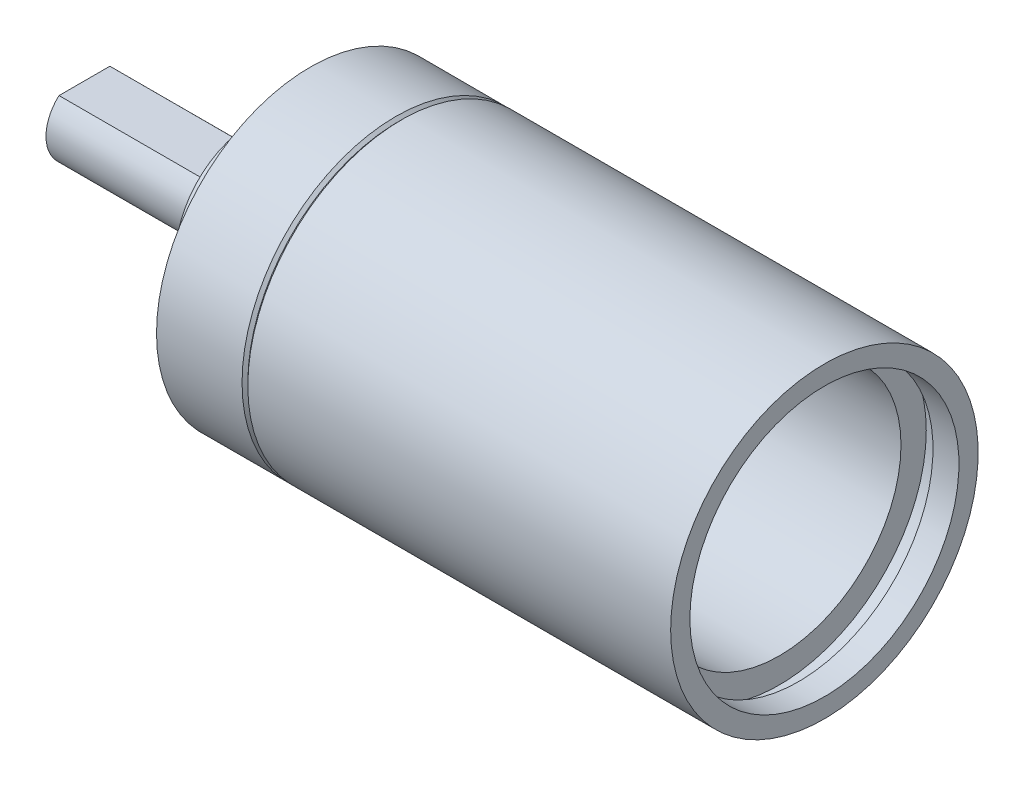
ISO-10303-21;
HEADER;
FILE_DESCRIPTION(('STEP AP214'),'2;1');
FILE_NAME('part.step','',(''),(''),'','','');
FILE_SCHEMA(('AUTOMOTIVE_DESIGN { 1 0 10303 214 1 1 1 1 }'));
ENDSEC;
DATA;
#1=APPLICATION_CONTEXT('core data for automotive mechanical design processes');
#2=APPLICATION_PROTOCOL_DEFINITION('international standard','automotive_design',2000,#1);
#3=PRODUCT_CONTEXT('',#1,'mechanical');
#4=PRODUCT('Part','Part','',(#3));
#5=PRODUCT_RELATED_PRODUCT_CATEGORY('part','',(#4));
#6=PRODUCT_DEFINITION_FORMATION('','',#4);
#7=PRODUCT_DEFINITION_CONTEXT('part definition',#1,'design');
#8=PRODUCT_DEFINITION('design','',#6,#7);
#9=PRODUCT_DEFINITION_SHAPE('','',#8);
#10=(LENGTH_UNIT() NAMED_UNIT(*) SI_UNIT(.MILLI.,.METRE.));
#11=(NAMED_UNIT(*) PLANE_ANGLE_UNIT() SI_UNIT($,.RADIAN.));
#12=(NAMED_UNIT(*) SI_UNIT($,.STERADIAN.) SOLID_ANGLE_UNIT());
#13=UNCERTAINTY_MEASURE_WITH_UNIT(LENGTH_MEASURE(1.E-05),#10,'distance_accuracy_value','');
#14=(GEOMETRIC_REPRESENTATION_CONTEXT(3) GLOBAL_UNCERTAINTY_ASSIGNED_CONTEXT((#13)) GLOBAL_UNIT_ASSIGNED_CONTEXT((#10,
#11,#12)) REPRESENTATION_CONTEXT('',''));
#15=CARTESIAN_POINT('',(0.,0.,0.));
#16=DIRECTION('',(0.,0.,1.));
#17=DIRECTION('',(1.,0.,0.));
#18=AXIS2_PLACEMENT_3D('',#15,#16,#17);
#19=CARTESIAN_POINT('',(-38.5000000000001,0.,0.));
#20=DIRECTION('',(-1.,0.,0.));
#21=DIRECTION('',(0.,0.,1.));
#22=AXIS2_PLACEMENT_3D('',#19,#20,#21);
#23=PLANE('',#22);
#24=CARTESIAN_POINT('',(-38.5000000000001,0.,0.));
#25=DIRECTION('',(-1.,0.,0.));
#26=DIRECTION('',(0.,0.,1.));
#27=AXIS2_PLACEMENT_3D('',#24,#25,#26);
#28=CIRCLE('',#27,2.);
#29=CARTESIAN_POINT('',(-38.5,1.50000000000003,1.32287565553226));
#30=VERTEX_POINT('',#29);
#31=CARTESIAN_POINT('',(-38.5,1.50000000000002,-1.32287565553225));
#32=VERTEX_POINT('',#31);
#33=EDGE_CURVE('E21',#30,#32,#28,.F.);
#34=ORIENTED_EDGE('',*,*,#33,.F.);
#35=DIRECTION('',(0.,0.,-1.));
#36=VECTOR('',#35,1.);
#37=CARTESIAN_POINT('',(-38.5,1.5,5.));
#38=LINE('',#37,#36);
#39=EDGE_CURVE('E59',#30,#32,#38,.T.);
#40=ORIENTED_EDGE('',*,*,#39,.T.);
#41=EDGE_LOOP('',(#34,#40));
#42=FACE_BOUND('',#41,.T.);
#43=ADVANCED_FACE('F18',(#42),#23,.T.);
#44=CARTESIAN_POINT('',(-30.5,1.5,5.));
#45=DIRECTION('',(0.707106781186547,-0.707106781186548,0.));
#46=DIRECTION('',(0.707106781186548,0.707106781186547,0.));
#47=AXIS2_PLACEMENT_3D('',#44,#45,#46);
#48=PLANE('',#47);
#49=DIRECTION('',(0.,0.,-1.));
#50=VECTOR('',#49,1.);
#51=CARTESIAN_POINT('',(-30.5,1.5,5.));
#52=LINE('',#51,#50);
#53=CARTESIAN_POINT('',(-30.4999999999999,1.50000000000004,-1.32287565553225));
#54=VERTEX_POINT('',#53);
#55=CARTESIAN_POINT('',(-30.4999999999999,1.50000000000003,1.32287565553226));
#56=VERTEX_POINT('',#55);
#57=EDGE_CURVE('E70',#54,#56,#52,.F.);
#58=ORIENTED_EDGE('',*,*,#57,.T.);
#59=CARTESIAN_POINT('',(-32.,0.,0.));
#60=DIRECTION('',(0.707106781186547,-0.707106781186548,0.));
#61=DIRECTION('',(-0.707106781186548,-0.707106781186547,0.));
#62=AXIS2_PLACEMENT_3D('',#59,#60,#61);
#63=ELLIPSE('',#62,2.82842712474619,2.);
#64=EDGE_CURVE('E74',#54,#56,#63,.T.);
#65=ORIENTED_EDGE('',*,*,#64,.F.);
#66=EDGE_LOOP('',(#58,#65));
#67=FACE_BOUND('',#66,.T.);
#68=ADVANCED_FACE('F157',(#67),#48,.F.);
#69=CARTESIAN_POINT('',(-38.5,1.5,5.));
#70=DIRECTION('',(0.,-1.,0.));
#71=DIRECTION('',(0.,0.,-1.));
#72=AXIS2_PLACEMENT_3D('',#69,#70,#71);
#73=PLANE('',#72);
#74=ORIENTED_EDGE('',*,*,#39,.F.);
#75=DIRECTION('',(-1.,0.,0.));
#76=VECTOR('',#75,1.);
#77=CARTESIAN_POINT('',(1.92499999999995,1.50000000000007,1.32287565553222));
#78=LINE('',#77,#76);
#79=EDGE_CURVE('E68',#56,#30,#78,.T.);
#80=ORIENTED_EDGE('',*,*,#79,.F.);
#81=ORIENTED_EDGE('',*,*,#57,.F.);
#82=DIRECTION('',(-1.,0.,0.));
#83=VECTOR('',#82,1.);
#84=CARTESIAN_POINT('',(1.92499999999995,1.50000000000007,-1.32287565553221));
#85=LINE('',#84,#83);
#86=EDGE_CURVE('E64',#32,#54,#85,.F.);
#87=ORIENTED_EDGE('',*,*,#86,.F.);
#88=EDGE_LOOP('',(#74,#80,#81,#87));
#89=FACE_BOUND('',#88,.T.);
#90=ADVANCED_FACE('F67',(#89),#73,.F.);
#91=CARTESIAN_POINT('',(1.92499999999995,0.,0.));
#92=DIRECTION('',(-1.,0.,0.));
#93=DIRECTION('',(0.,0.,1.));
#94=AXIS2_PLACEMENT_3D('',#91,#92,#93);
#95=CYLINDRICAL_SURFACE('',#94,2.);
#96=CARTESIAN_POINT('',(-29.7500000000001,0.,0.));
#97=DIRECTION('',(-1.,0.,0.));
#98=DIRECTION('',(0.,0.,1.));
#99=AXIS2_PLACEMENT_3D('',#96,#97,#98);
#100=CIRCLE('',#99,2.);
#101=CARTESIAN_POINT('',(-29.7500000000001,0.,2.00000000000001));
#102=VERTEX_POINT('',#101);
#103=EDGE_CURVE('E75',#102,#102,#100,.F.);
#104=ORIENTED_EDGE('',*,*,#103,.F.);
#105=EDGE_LOOP('',(#104));
#106=FACE_BOUND('',#105,.T.);
#107=ORIENTED_EDGE('',*,*,#79,.T.);
#108=ORIENTED_EDGE('',*,*,#33,.T.);
#109=ORIENTED_EDGE('',*,*,#86,.T.);
#110=ORIENTED_EDGE('',*,*,#64,.T.);
#111=EDGE_LOOP('',(#107,#108,#109,#110));
#112=FACE_BOUND('',#111,.T.);
#113=ADVANCED_FACE('F72',(#106,#112),#95,.T.);
#114=CARTESIAN_POINT('',(-29.7500000000001,0.,0.));
#115=DIRECTION('',(-1.,0.,0.));
#116=DIRECTION('',(0.,0.,1.));
#117=AXIS2_PLACEMENT_3D('',#114,#115,#116);
#118=PLANE('',#117);
#119=CARTESIAN_POINT('',(-29.7500000000001,0.,0.));
#120=DIRECTION('',(-1.,0.,0.));
#121=DIRECTION('',(0.,0.,1.));
#122=AXIS2_PLACEMENT_3D('',#119,#120,#121);
#123=CIRCLE('',#122,4.);
#124=CARTESIAN_POINT('',(-29.7500000000001,0.,4.00000000000001));
#125=VERTEX_POINT('',#124);
#126=EDGE_CURVE('E78',#125,#125,#123,.F.);
#127=ORIENTED_EDGE('',*,*,#126,.F.);
#128=EDGE_LOOP('',(#127));
#129=FACE_BOUND('',#128,.T.);
#130=ORIENTED_EDGE('',*,*,#103,.T.);
#131=EDGE_LOOP('',(#130));
#132=FACE_BOUND('',#131,.T.);
#133=ADVANCED_FACE('F144',(#129,#132),#118,.T.);
#134=CARTESIAN_POINT('',(-21.7000000000001,0.,0.));
#135=DIRECTION('',(-1.,0.,0.));
#136=DIRECTION('',(0.,0.,1.));
#137=AXIS2_PLACEMENT_3D('',#134,#135,#136);
#138=PLANE('',#137);
#139=CARTESIAN_POINT('',(-21.7000000000001,0.,0.));
#140=DIRECTION('',(-1.,0.,0.));
#141=DIRECTION('',(0.,0.,1.));
#142=AXIS2_PLACEMENT_3D('',#139,#140,#141);
#143=CIRCLE('',#142,6.335);
#144=CARTESIAN_POINT('',(-21.7000000000001,0.,6.335));
#145=VERTEX_POINT('',#144);
#146=EDGE_CURVE('E136',#145,#145,#143,.F.);
#147=ORIENTED_EDGE('',*,*,#146,.T.);
#148=EDGE_LOOP('',(#147));
#149=FACE_BOUND('',#148,.T.);
#150=ADVANCED_FACE('F147',(#149),#138,.F.);
#151=CARTESIAN_POINT('',(1.92499999999995,0.,0.));
#152=DIRECTION('',(-1.,0.,0.));
#153=DIRECTION('',(0.,0.,1.));
#154=AXIS2_PLACEMENT_3D('',#151,#152,#153);
#155=CYLINDRICAL_SURFACE('',#154,4.);
#156=CARTESIAN_POINT('',(-27.9,0.,0.));
#157=DIRECTION('',(-1.,0.,0.));
#158=DIRECTION('',(0.,0.,1.));
#159=AXIS2_PLACEMENT_3D('',#156,#157,#158);
#160=CIRCLE('',#159,4.);
#161=CARTESIAN_POINT('',(-27.9,0.,4.00000000000001));
#162=VERTEX_POINT('',#161);
#163=EDGE_CURVE('E133',#162,#162,#160,.F.);
#164=ORIENTED_EDGE('',*,*,#163,.F.);
#165=EDGE_LOOP('',(#164));
#166=FACE_BOUND('',#165,.T.);
#167=ORIENTED_EDGE('',*,*,#126,.T.);
#168=EDGE_LOOP('',(#167));
#169=FACE_BOUND('',#168,.T.);
#170=ADVANCED_FACE('F142',(#166,#169),#155,.T.);
#171=CARTESIAN_POINT('',(1.92499999999995,0.,0.));
#172=DIRECTION('',(-1.,0.,0.));
#173=DIRECTION('',(0.,0.,1.));
#174=AXIS2_PLACEMENT_3D('',#171,#172,#173);
#175=CYLINDRICAL_SURFACE('',#174,6.335);
#176=CARTESIAN_POINT('',(-2.35000000000002,0.,0.));
#177=DIRECTION('',(-1.,0.,0.));
#178=DIRECTION('',(0.,0.,1.));
#179=AXIS2_PLACEMENT_3D('',#176,#177,#178);
#180=CIRCLE('',#179,6.335);
#181=CARTESIAN_POINT('',(-2.35000000000002,0.,6.33500000000001));
#182=VERTEX_POINT('',#181);
#183=EDGE_CURVE('E130',#182,#182,#180,.F.);
#184=ORIENTED_EDGE('',*,*,#183,.T.);
#185=EDGE_LOOP('',(#184));
#186=FACE_BOUND('',#185,.T.);
#187=ORIENTED_EDGE('',*,*,#146,.F.);
#188=EDGE_LOOP('',(#187));
#189=FACE_BOUND('',#188,.T.);
#190=ADVANCED_FACE('F257',(#186,#189),#175,.F.);
#191=CARTESIAN_POINT('',(-22.872748738564,3.25,5.629165124599));
#192=DIRECTION('',(-1.,0.,0.));
#193=DIRECTION('',(0.,0.,1.));
#194=AXIS2_PLACEMENT_3D('',#191,#192,#193);
#195=CONICAL_SURFACE('',#194,0.870000000002384,1.02974425843473);
#196=CARTESIAN_POINT('',(-22.349999999733,3.25,5.62916512447487));
#197=VERTEX_POINT('',#196);
#198=VERTEX_LOOP('',#197);
#199=FACE_BOUND('',#198,.T.);
#200=CARTESIAN_POINT('',(-22.8727487385501,3.25,5.629165124599));
#201=DIRECTION('',(1.,0.,0.));
#202=DIRECTION('',(0.,0.,-1.));
#203=AXIS2_PLACEMENT_3D('',#200,#201,#202);
#204=CIRCLE('',#203,0.87);
#205=CARTESIAN_POINT('',(-22.8727487385501,3.25,4.759165124599));
#206=VERTEX_POINT('',#205);
#207=EDGE_CURVE('E82',#206,#206,#204,.F.);
#208=ORIENTED_EDGE('',*,*,#207,.T.);
#209=EDGE_LOOP('',(#208));
#210=FACE_BOUND('',#209,.T.);
#211=ADVANCED_FACE('F253',(#199,#210),#195,.F.);
#212=CARTESIAN_POINT('',(-22.872748738564,-3.25,5.62916512459901));
#213=DIRECTION('',(-1.,0.,0.));
#214=DIRECTION('',(0.,0.,1.));
#215=AXIS2_PLACEMENT_3D('',#212,#213,#214);
#216=CONICAL_SURFACE('',#215,0.870000000002387,1.02974425843474);
#217=CARTESIAN_POINT('',(-22.349999999733,-3.25,5.62916512459901));
#218=VERTEX_POINT('',#217);
#219=VERTEX_LOOP('',#218);
#220=FACE_BOUND('',#219,.T.);
#221=CARTESIAN_POINT('',(-22.8727487385501,-3.25000000000001,5.629165124599));
#222=DIRECTION('',(1.,0.,0.));
#223=DIRECTION('',(0.,0.,-1.));
#224=AXIS2_PLACEMENT_3D('',#221,#222,#223);
#225=CIRCLE('',#224,0.87);
#226=CARTESIAN_POINT('',(-22.8727487385501,-3.25000000000001,4.759165124599));
#227=VERTEX_POINT('',#226);
#228=EDGE_CURVE('E478',#227,#227,#225,.F.);
#229=ORIENTED_EDGE('',*,*,#228,.T.);
#230=EDGE_LOOP('',(#229));
#231=FACE_BOUND('',#230,.T.);
#232=ADVANCED_FACE('F249',(#220,#231),#216,.F.);
#233=CARTESIAN_POINT('',(-22.8727487385072,-6.5,0.));
#234=DIRECTION('',(-1.,0.,0.));
#235=DIRECTION('',(0.,0.,1.));
#236=AXIS2_PLACEMENT_3D('',#233,#234,#235);
#237=CONICAL_SURFACE('',#236,0.869999999906668,1.02974425821274);
#238=CARTESIAN_POINT('',(-22.3499999996193,-6.5,0.));
#239=VERTEX_POINT('',#238);
#240=VERTEX_LOOP('',#239);
#241=FACE_BOUND('',#240,.T.);
#242=CARTESIAN_POINT('',(-22.8727487385501,-6.5,0.));
#243=DIRECTION('',(1.,0.,0.));
#244=DIRECTION('',(0.,0.,-1.));
#245=AXIS2_PLACEMENT_3D('',#242,#243,#244);
#246=CIRCLE('',#245,0.87);
#247=CARTESIAN_POINT('',(-22.8727487385501,-6.5,-0.869999999999986));
#248=VERTEX_POINT('',#247);
#249=EDGE_CURVE('E480',#248,#248,#246,.F.);
#250=ORIENTED_EDGE('',*,*,#249,.T.);
#251=EDGE_LOOP('',(#250));
#252=FACE_BOUND('',#251,.T.);
#253=ADVANCED_FACE('F245',(#241,#252),#237,.F.);
#254=CARTESIAN_POINT('',(-22.8727487386209,-3.25,-5.62916512459899));
#255=DIRECTION('',(-1.,0.,0.));
#256=DIRECTION('',(0.,0.,1.));
#257=AXIS2_PLACEMENT_3D('',#254,#255,#256);
#258=CONICAL_SURFACE('',#257,0.869999999981497,1.02974425833669);
#259=CARTESIAN_POINT('',(-22.3499999997614,-3.25,-5.62916512467382));
#260=VERTEX_POINT('',#259);
#261=VERTEX_LOOP('',#260);
#262=FACE_BOUND('',#261,.T.);
#263=CARTESIAN_POINT('',(-22.8727487385501,-3.25000000000001,-5.629165124599));
#264=DIRECTION('',(1.,0.,0.));
#265=DIRECTION('',(0.,0.,-1.));
#266=AXIS2_PLACEMENT_3D('',#263,#264,#265);
#267=CIRCLE('',#266,0.87);
#268=CARTESIAN_POINT('',(-22.8727487385501,-3.25000000000001,-6.499165124599));
#269=VERTEX_POINT('',#268);
#270=EDGE_CURVE('E484',#269,#269,#267,.F.);
#271=ORIENTED_EDGE('',*,*,#270,.T.);
#272=EDGE_LOOP('',(#271));
#273=FACE_BOUND('',#272,.T.);
#274=ADVANCED_FACE('F241',(#262,#273),#258,.F.);
#275=CARTESIAN_POINT('',(-22.8727487386209,3.25,-5.629165124599));
#276=DIRECTION('',(-1.,0.,0.));
#277=DIRECTION('',(0.,0.,1.));
#278=AXIS2_PLACEMENT_3D('',#275,#276,#277);
#279=CONICAL_SURFACE('',#278,0.86999999998149,1.02974425833668);
#280=CARTESIAN_POINT('',(-22.3499999997898,3.25,-5.629165124599));
#281=VERTEX_POINT('',#280);
#282=VERTEX_LOOP('',#281);
#283=FACE_BOUND('',#282,.T.);
#284=CARTESIAN_POINT('',(-22.8727487385501,3.25,-5.62916512459898));
#285=DIRECTION('',(1.,0.,0.));
#286=DIRECTION('',(0.,0.,-1.));
#287=AXIS2_PLACEMENT_3D('',#284,#285,#286);
#288=CIRCLE('',#287,0.87);
#289=CARTESIAN_POINT('',(-22.8727487385501,3.25,-6.49916512459898));
#290=VERTEX_POINT('',#289);
#291=EDGE_CURVE('E489',#290,#290,#288,.F.);
#292=ORIENTED_EDGE('',*,*,#291,.T.);
#293=EDGE_LOOP('',(#292));
#294=FACE_BOUND('',#293,.T.);
#295=ADVANCED_FACE('F238',(#283,#294),#279,.F.);
#296=CARTESIAN_POINT('',(-22.8727487385072,6.5,0.));
#297=DIRECTION('',(-1.,0.,0.));
#298=DIRECTION('',(0.,0.,1.));
#299=AXIS2_PLACEMENT_3D('',#296,#297,#298);
#300=CONICAL_SURFACE('',#299,0.869999999906675,1.02974425821274);
#301=CARTESIAN_POINT('',(-22.3499999995909,6.5,5.68503758913403E-11));
#302=VERTEX_POINT('',#301);
#303=VERTEX_LOOP('',#302);
#304=FACE_BOUND('',#303,.T.);
#305=CARTESIAN_POINT('',(-22.8727487385501,6.5,0.));
#306=DIRECTION('',(1.,0.,0.));
#307=DIRECTION('',(0.,0.,-1.));
#308=AXIS2_PLACEMENT_3D('',#305,#306,#307);
#309=CIRCLE('',#308,0.87);
#310=CARTESIAN_POINT('',(-22.8727487385501,6.5,-0.869999999999993));
#311=VERTEX_POINT('',#310);
#312=EDGE_CURVE('E129',#311,#311,#309,.F.);
#313=ORIENTED_EDGE('',*,*,#312,.T.);
#314=EDGE_LOOP('',(#313));
#315=FACE_BOUND('',#314,.T.);
#316=ADVANCED_FACE('F234',(#304,#315),#300,.F.);
#317=CARTESIAN_POINT('',(-27.9,0.,0.));
#318=DIRECTION('',(-1.,0.,0.));
#319=DIRECTION('',(0.,0.,1.));
#320=AXIS2_PLACEMENT_3D('',#317,#318,#319);
#321=PLANE('',#320);
#322=CARTESIAN_POINT('',(-27.9,0.,0.));
#323=DIRECTION('',(-1.,0.,0.));
#324=DIRECTION('',(0.,0.,1.));
#325=AXIS2_PLACEMENT_3D('',#322,#323,#324);
#326=CIRCLE('',#325,5.);
#327=CARTESIAN_POINT('',(-27.9,0.,5.00000000000001));
#328=VERTEX_POINT('',#327);
#329=EDGE_CURVE('E126',#328,#328,#326,.F.);
#330=ORIENTED_EDGE('',*,*,#329,.F.);
#331=EDGE_LOOP('',(#330));
#332=FACE_BOUND('',#331,.T.);
#333=ORIENTED_EDGE('',*,*,#163,.T.);
#334=EDGE_LOOP('',(#333));
#335=FACE_BOUND('',#334,.T.);
#336=ADVANCED_FACE('F230',(#332,#335),#321,.T.);
#337=CARTESIAN_POINT('',(-2.35000000000002,0.,0.));
#338=DIRECTION('',(-1.,0.,0.));
#339=DIRECTION('',(0.,0.,1.));
#340=AXIS2_PLACEMENT_3D('',#337,#338,#339);
#341=PLANE('',#340);
#342=CARTESIAN_POINT('',(-2.35000000000002,0.,0.));
#343=DIRECTION('',(-1.,0.,0.));
#344=DIRECTION('',(0.,0.,1.));
#345=AXIS2_PLACEMENT_3D('',#342,#343,#344);
#346=CIRCLE('',#345,7.65);
#347=CARTESIAN_POINT('',(-2.35000000000002,0.,7.65000000000001));
#348=VERTEX_POINT('',#347);
#349=EDGE_CURVE('E123',#348,#348,#346,.F.);
#350=ORIENTED_EDGE('',*,*,#349,.T.);
#351=EDGE_LOOP('',(#350));
#352=FACE_BOUND('',#351,.T.);
#353=ORIENTED_EDGE('',*,*,#183,.F.);
#354=EDGE_LOOP('',(#353));
#355=FACE_BOUND('',#354,.T.);
#356=ADVANCED_FACE('F226',(#352,#355),#341,.F.);
#357=CARTESIAN_POINT('',(-26.97,3.25,5.629165124599));
#358=DIRECTION('',(1.,0.,0.));
#359=DIRECTION('',(0.,0.,-1.));
#360=AXIS2_PLACEMENT_3D('',#357,#358,#359);
#361=CYLINDRICAL_SURFACE('',#360,0.87);
#362=CARTESIAN_POINT('',(-26.75,3.25,5.629165124599));
#363=DIRECTION('',(1.,0.,0.));
#364=DIRECTION('',(0.,0.,-1.));
#365=AXIS2_PLACEMENT_3D('',#362,#363,#364);
#366=CIRCLE('',#365,0.87);
#367=CARTESIAN_POINT('',(-26.75,3.25,4.759165124599));
#368=VERTEX_POINT('',#367);
#369=EDGE_CURVE('E120',#368,#368,#366,.T.);
#370=ORIENTED_EDGE('',*,*,#369,.F.);
#371=EDGE_LOOP('',(#370));
#372=FACE_BOUND('',#371,.T.);
#373=ORIENTED_EDGE('',*,*,#207,.F.);
#374=EDGE_LOOP('',(#373));
#375=FACE_BOUND('',#374,.T.);
#376=ADVANCED_FACE('F222',(#372,#375),#361,.F.);
#377=CARTESIAN_POINT('',(-26.97,-3.25000000000001,5.629165124599));
#378=DIRECTION('',(1.,0.,0.));
#379=DIRECTION('',(0.,0.,-1.));
#380=AXIS2_PLACEMENT_3D('',#377,#378,#379);
#381=CYLINDRICAL_SURFACE('',#380,0.87);
#382=CARTESIAN_POINT('',(-26.75,-3.25000000000001,5.629165124599));
#383=DIRECTION('',(1.,0.,0.));
#384=DIRECTION('',(0.,0.,-1.));
#385=AXIS2_PLACEMENT_3D('',#382,#383,#384);
#386=CIRCLE('',#385,0.87);
#387=CARTESIAN_POINT('',(-26.75,-3.25000000000001,4.759165124599));
#388=VERTEX_POINT('',#387);
#389=EDGE_CURVE('E117',#388,#388,#386,.T.);
#390=ORIENTED_EDGE('',*,*,#389,.F.);
#391=EDGE_LOOP('',(#390));
#392=FACE_BOUND('',#391,.T.);
#393=ORIENTED_EDGE('',*,*,#228,.F.);
#394=EDGE_LOOP('',(#393));
#395=FACE_BOUND('',#394,.T.);
#396=ADVANCED_FACE('F218',(#392,#395),#381,.F.);
#397=CARTESIAN_POINT('',(-26.97,-6.5,0.));
#398=DIRECTION('',(1.,0.,0.));
#399=DIRECTION('',(0.,0.,-1.));
#400=AXIS2_PLACEMENT_3D('',#397,#398,#399);
#401=CYLINDRICAL_SURFACE('',#400,0.87);
#402=CARTESIAN_POINT('',(-26.75,-6.5,0.));
#403=DIRECTION('',(1.,0.,0.));
#404=DIRECTION('',(0.,0.,-1.));
#405=AXIS2_PLACEMENT_3D('',#402,#403,#404);
#406=CIRCLE('',#405,0.87);
#407=CARTESIAN_POINT('',(-26.75,-6.5,-0.869999999999986));
#408=VERTEX_POINT('',#407);
#409=EDGE_CURVE('E114',#408,#408,#406,.T.);
#410=ORIENTED_EDGE('',*,*,#409,.F.);
#411=EDGE_LOOP('',(#410));
#412=FACE_BOUND('',#411,.T.);
#413=ORIENTED_EDGE('',*,*,#249,.F.);
#414=EDGE_LOOP('',(#413));
#415=FACE_BOUND('',#414,.T.);
#416=ADVANCED_FACE('F214',(#412,#415),#401,.F.);
#417=CARTESIAN_POINT('',(-26.97,-3.25000000000001,-5.629165124599));
#418=DIRECTION('',(1.,0.,0.));
#419=DIRECTION('',(0.,0.,-1.));
#420=AXIS2_PLACEMENT_3D('',#417,#418,#419);
#421=CYLINDRICAL_SURFACE('',#420,0.87);
#422=CARTESIAN_POINT('',(-26.75,-3.25000000000001,-5.629165124599));
#423=DIRECTION('',(1.,0.,0.));
#424=DIRECTION('',(0.,0.,-1.));
#425=AXIS2_PLACEMENT_3D('',#422,#423,#424);
#426=CIRCLE('',#425,0.87);
#427=CARTESIAN_POINT('',(-26.75,-3.25000000000001,-6.499165124599));
#428=VERTEX_POINT('',#427);
#429=EDGE_CURVE('E111',#428,#428,#426,.T.);
#430=ORIENTED_EDGE('',*,*,#429,.F.);
#431=EDGE_LOOP('',(#430));
#432=FACE_BOUND('',#431,.T.);
#433=ORIENTED_EDGE('',*,*,#270,.F.);
#434=EDGE_LOOP('',(#433));
#435=FACE_BOUND('',#434,.T.);
#436=ADVANCED_FACE('F210',(#432,#435),#421,.F.);
#437=CARTESIAN_POINT('',(-26.97,3.25,-5.62916512459898));
#438=DIRECTION('',(1.,0.,0.));
#439=DIRECTION('',(0.,0.,-1.));
#440=AXIS2_PLACEMENT_3D('',#437,#438,#439);
#441=CYLINDRICAL_SURFACE('',#440,0.87);
#442=CARTESIAN_POINT('',(-26.75,3.25,-5.62916512459898));
#443=DIRECTION('',(1.,0.,0.));
#444=DIRECTION('',(0.,0.,-1.));
#445=AXIS2_PLACEMENT_3D('',#442,#443,#444);
#446=CIRCLE('',#445,0.87);
#447=CARTESIAN_POINT('',(-26.75,3.25,-6.49916512459898));
#448=VERTEX_POINT('',#447);
#449=EDGE_CURVE('E108',#448,#448,#446,.T.);
#450=ORIENTED_EDGE('',*,*,#449,.F.);
#451=EDGE_LOOP('',(#450));
#452=FACE_BOUND('',#451,.T.);
#453=ORIENTED_EDGE('',*,*,#291,.F.);
#454=EDGE_LOOP('',(#453));
#455=FACE_BOUND('',#454,.T.);
#456=ADVANCED_FACE('F206',(#452,#455),#441,.F.);
#457=CARTESIAN_POINT('',(-26.97,6.5,0.));
#458=DIRECTION('',(1.,0.,0.));
#459=DIRECTION('',(0.,0.,-1.));
#460=AXIS2_PLACEMENT_3D('',#457,#458,#459);
#461=CYLINDRICAL_SURFACE('',#460,0.87);
#462=CARTESIAN_POINT('',(-26.75,6.5,0.));
#463=DIRECTION('',(1.,0.,0.));
#464=DIRECTION('',(0.,0.,-1.));
#465=AXIS2_PLACEMENT_3D('',#462,#463,#464);
#466=CIRCLE('',#465,0.87);
#467=CARTESIAN_POINT('',(-26.75,6.5,-0.869999999999993));
#468=VERTEX_POINT('',#467);
#469=EDGE_CURVE('E105',#468,#468,#466,.T.);
#470=ORIENTED_EDGE('',*,*,#469,.F.);
#471=EDGE_LOOP('',(#470));
#472=FACE_BOUND('',#471,.T.);
#473=ORIENTED_EDGE('',*,*,#312,.F.);
#474=EDGE_LOOP('',(#473));
#475=FACE_BOUND('',#474,.T.);
#476=ADVANCED_FACE('F202',(#472,#475),#461,.F.);
#477=CARTESIAN_POINT('',(1.92499999999995,0.,0.));
#478=DIRECTION('',(-1.,0.,0.));
#479=DIRECTION('',(0.,0.,1.));
#480=AXIS2_PLACEMENT_3D('',#477,#478,#479);
#481=CYLINDRICAL_SURFACE('',#480,5.);
#482=CARTESIAN_POINT('',(-26.75,0.,0.));
#483=DIRECTION('',(-1.,0.,0.));
#484=DIRECTION('',(0.,0.,1.));
#485=AXIS2_PLACEMENT_3D('',#482,#483,#484);
#486=CIRCLE('',#485,5.);
#487=CARTESIAN_POINT('',(-26.75,0.,5.00000000000001));
#488=VERTEX_POINT('',#487);
#489=EDGE_CURVE('E102',#488,#488,#486,.F.);
#490=ORIENTED_EDGE('',*,*,#489,.F.);
#491=EDGE_LOOP('',(#490));
#492=FACE_BOUND('',#491,.T.);
#493=ORIENTED_EDGE('',*,*,#329,.T.);
#494=EDGE_LOOP('',(#493));
#495=FACE_BOUND('',#494,.T.);
#496=ADVANCED_FACE('F198',(#492,#495),#481,.T.);
#497=CARTESIAN_POINT('',(1.92499999999995,0.,0.));
#498=DIRECTION('',(-1.,0.,0.));
#499=DIRECTION('',(0.,0.,1.));
#500=AXIS2_PLACEMENT_3D('',#497,#498,#499);
#501=CYLINDRICAL_SURFACE('',#500,7.65);
#502=CARTESIAN_POINT('',(-1.35000000000002,0.,0.));
#503=DIRECTION('',(-1.,0.,0.));
#504=DIRECTION('',(0.,0.,1.));
#505=AXIS2_PLACEMENT_3D('',#502,#503,#504);
#506=CIRCLE('',#505,7.65);
#507=CARTESIAN_POINT('',(-1.35000000000002,0.,7.65000000000001));
#508=VERTEX_POINT('',#507);
#509=EDGE_CURVE('E99',#508,#508,#506,.T.);
#510=ORIENTED_EDGE('',*,*,#509,.F.);
#511=EDGE_LOOP('',(#510));
#512=FACE_BOUND('',#511,.T.);
#513=ORIENTED_EDGE('',*,*,#349,.F.);
#514=EDGE_LOOP('',(#513));
#515=FACE_BOUND('',#514,.T.);
#516=ADVANCED_FACE('F194',(#512,#515),#501,.F.);
#517=CARTESIAN_POINT('',(-26.75,0.,0.));
#518=DIRECTION('',(-1.,0.,0.));
#519=DIRECTION('',(0.,0.,1.));
#520=AXIS2_PLACEMENT_3D('',#517,#518,#519);
#521=PLANE('',#520);
#522=CARTESIAN_POINT('',(-26.75,0.,0.));
#523=DIRECTION('',(-1.,0.,0.));
#524=DIRECTION('',(0.,0.,1.));
#525=AXIS2_PLACEMENT_3D('',#522,#523,#524);
#526=CIRCLE('',#525,8.);
#527=CARTESIAN_POINT('',(-26.75,0.,8.));
#528=VERTEX_POINT('',#527);
#529=EDGE_CURVE('E96',#528,#528,#526,.F.);
#530=ORIENTED_EDGE('',*,*,#529,.F.);
#531=EDGE_LOOP('',(#530));
#532=FACE_BOUND('',#531,.T.);
#533=ORIENTED_EDGE('',*,*,#489,.T.);
#534=EDGE_LOOP('',(#533));
#535=FACE_BOUND('',#534,.T.);
#536=ORIENTED_EDGE('',*,*,#469,.T.);
#537=EDGE_LOOP('',(#536));
#538=FACE_BOUND('',#537,.T.);
#539=ORIENTED_EDGE('',*,*,#449,.T.);
#540=EDGE_LOOP('',(#539));
#541=FACE_BOUND('',#540,.T.);
#542=ORIENTED_EDGE('',*,*,#429,.T.);
#543=EDGE_LOOP('',(#542));
#544=FACE_BOUND('',#543,.T.);
#545=ORIENTED_EDGE('',*,*,#409,.T.);
#546=EDGE_LOOP('',(#545));
#547=FACE_BOUND('',#546,.T.);
#548=ORIENTED_EDGE('',*,*,#389,.T.);
#549=EDGE_LOOP('',(#548));
#550=FACE_BOUND('',#549,.T.);
#551=ORIENTED_EDGE('',*,*,#369,.T.);
#552=EDGE_LOOP('',(#551));
#553=FACE_BOUND('',#552,.T.);
#554=ADVANCED_FACE('F190',(#532,#535,#538,#541,#544,#547,#550,#553),#521,.T.);
#555=CARTESIAN_POINT('',(-1.35000000000002,0.,0.));
#556=DIRECTION('',(-1.,0.,0.));
#557=DIRECTION('',(0.,0.,1.));
#558=AXIS2_PLACEMENT_3D('',#555,#556,#557);
#559=PLANE('',#558);
#560=ORIENTED_EDGE('',*,*,#509,.T.);
#561=EDGE_LOOP('',(#560));
#562=FACE_BOUND('',#561,.T.);
#563=CARTESIAN_POINT('',(-1.35000000000002,0.,0.));
#564=DIRECTION('',(-1.,0.,0.));
#565=DIRECTION('',(0.,0.,1.));
#566=AXIS2_PLACEMENT_3D('',#563,#564,#565);
#567=CIRCLE('',#566,7.);
#568=CARTESIAN_POINT('',(-1.35000000000002,0.,7.00000000000001));
#569=VERTEX_POINT('',#568);
#570=EDGE_CURVE('E93',#569,#569,#567,.F.);
#571=ORIENTED_EDGE('',*,*,#570,.T.);
#572=EDGE_LOOP('',(#571));
#573=FACE_BOUND('',#572,.T.);
#574=ADVANCED_FACE('F186',(#562,#573),#559,.T.);
#575=CARTESIAN_POINT('',(1.92499999999995,0.,0.));
#576=DIRECTION('',(-1.,0.,0.));
#577=DIRECTION('',(0.,0.,1.));
#578=AXIS2_PLACEMENT_3D('',#575,#576,#577);
#579=CYLINDRICAL_SURFACE('',#578,8.);
#580=ORIENTED_EDGE('',*,*,#529,.T.);
#581=EDGE_LOOP('',(#580));
#582=FACE_BOUND('',#581,.T.);
#583=CARTESIAN_POINT('',(-22.3000000000001,0.,0.));
#584=DIRECTION('',(-1.,0.,0.));
#585=DIRECTION('',(0.,0.,-1.));
#586=AXIS2_PLACEMENT_3D('',#583,#584,#585);
#587=CIRCLE('',#586,7.99999999999999);
#588=CARTESIAN_POINT('',(-22.3000000000001,0.,-7.99999999999997));
#589=VERTEX_POINT('',#588);
#590=EDGE_CURVE('E92',#589,#589,#587,.F.);
#591=ORIENTED_EDGE('',*,*,#590,.F.);
#592=EDGE_LOOP('',(#591));
#593=FACE_BOUND('',#592,.T.);
#594=ADVANCED_FACE('F182',(#582,#593),#579,.T.);
#595=CARTESIAN_POINT('',(1.92499999999995,0.,0.));
#596=DIRECTION('',(-1.,0.,0.));
#597=DIRECTION('',(0.,0.,1.));
#598=AXIS2_PLACEMENT_3D('',#595,#596,#597);
#599=CYLINDRICAL_SURFACE('',#598,7.);
#600=CARTESIAN_POINT('',(0.,0.,0.));
#601=DIRECTION('',(-1.,0.,0.));
#602=DIRECTION('',(0.,0.,1.));
#603=AXIS2_PLACEMENT_3D('',#600,#601,#602);
#604=CIRCLE('',#603,7.);
#605=CARTESIAN_POINT('',(0.,0.,7.00000000000001));
#606=VERTEX_POINT('',#605);
#607=EDGE_CURVE('E89',#606,#606,#604,.F.);
#608=ORIENTED_EDGE('',*,*,#607,.T.);
#609=EDGE_LOOP('',(#608));
#610=FACE_BOUND('',#609,.T.);
#611=ORIENTED_EDGE('',*,*,#570,.F.);
#612=EDGE_LOOP('',(#611));
#613=FACE_BOUND('',#612,.T.);
#614=ADVANCED_FACE('F178',(#610,#613),#599,.F.);
#615=CARTESIAN_POINT('',(-22.3000000000001,0.,0.));
#616=DIRECTION('',(-1.,0.,0.));
#617=DIRECTION('',(0.,0.,1.));
#618=AXIS2_PLACEMENT_3D('',#615,#616,#617);
#619=CONICAL_SURFACE('',#618,7.99999999999999,0.785398163397298);
#620=ORIENTED_EDGE('',*,*,#590,.T.);
#621=EDGE_LOOP('',(#620));
#622=FACE_BOUND('',#621,.T.);
#623=CARTESIAN_POINT('',(-22.1500000000001,0.,0.));
#624=DIRECTION('',(1.,0.,0.));
#625=DIRECTION('',(0.,0.,1.));
#626=AXIS2_PLACEMENT_3D('',#623,#624,#625);
#627=CIRCLE('',#626,7.85);
#628=CARTESIAN_POINT('',(-22.1500000000001,0.,7.85000000000001));
#629=VERTEX_POINT('',#628);
#630=EDGE_CURVE('E88',#629,#629,#627,.T.);
#631=ORIENTED_EDGE('',*,*,#630,.F.);
#632=EDGE_LOOP('',(#631));
#633=FACE_BOUND('',#632,.T.);
#634=ADVANCED_FACE('F174',(#622,#633),#619,.T.);
#635=CARTESIAN_POINT('',(0.,0.,0.));
#636=DIRECTION('',(-1.,0.,0.));
#637=DIRECTION('',(0.,0.,1.));
#638=AXIS2_PLACEMENT_3D('',#635,#636,#637);
#639=PLANE('',#638);
#640=CARTESIAN_POINT('',(0.,0.,0.));
#641=DIRECTION('',(-1.,0.,0.));
#642=DIRECTION('',(0.,0.,1.));
#643=AXIS2_PLACEMENT_3D('',#640,#641,#642);
#644=CIRCLE('',#643,8.);
#645=CARTESIAN_POINT('',(0.,0.,8.00000000000001));
#646=VERTEX_POINT('',#645);
#647=EDGE_CURVE('E27',#646,#646,#644,.T.);
#648=ORIENTED_EDGE('',*,*,#647,.F.);
#649=EDGE_LOOP('',(#648));
#650=FACE_BOUND('',#649,.T.);
#651=ORIENTED_EDGE('',*,*,#607,.F.);
#652=EDGE_LOOP('',(#651));
#653=FACE_BOUND('',#652,.T.);
#654=ADVANCED_FACE('F167',(#650,#653),#639,.F.);
#655=CARTESIAN_POINT('',(-22.,0.,0.));
#656=DIRECTION('',(1.,0.,0.));
#657=DIRECTION('',(0.,0.,-1.));
#658=AXIS2_PLACEMENT_3D('',#655,#656,#657);
#659=CONICAL_SURFACE('',#658,7.99999999999999,0.785398163397292);
#660=CARTESIAN_POINT('',(-22.,0.,0.));
#661=DIRECTION('',(-1.,0.,0.));
#662=DIRECTION('',(0.,0.,1.));
#663=AXIS2_PLACEMENT_3D('',#660,#661,#662);
#664=CIRCLE('',#663,8.);
#665=CARTESIAN_POINT('',(-22.,0.,8.00000000000001));
#666=VERTEX_POINT('',#665);
#667=EDGE_CURVE('E11',#666,#666,#664,.F.);
#668=ORIENTED_EDGE('',*,*,#667,.F.);
#669=EDGE_LOOP('',(#668));
#670=FACE_BOUND('',#669,.T.);
#671=ORIENTED_EDGE('',*,*,#630,.T.);
#672=EDGE_LOOP('',(#671));
#673=FACE_BOUND('',#672,.T.);
#674=ADVANCED_FACE('F161',(#670,#673),#659,.T.);
#675=CARTESIAN_POINT('',(1.92499999999995,0.,0.));
#676=DIRECTION('',(-1.,0.,0.));
#677=DIRECTION('',(0.,0.,1.));
#678=AXIS2_PLACEMENT_3D('',#675,#676,#677);
#679=CYLINDRICAL_SURFACE('',#678,8.);
#680=ORIENTED_EDGE('',*,*,#667,.T.);
#681=EDGE_LOOP('',(#680));
#682=FACE_BOUND('',#681,.T.);
#683=ORIENTED_EDGE('',*,*,#647,.T.);
#684=EDGE_LOOP('',(#683));
#685=FACE_BOUND('',#684,.T.);
#686=ADVANCED_FACE('F159',(#682,#685),#679,.T.);
#687=CLOSED_SHELL('',(#43,#68,#90,#113,#133,#150,#170,#190,#211,#232,#253,#274,#295,#316,#336,
#356,#376,#396,#416,#436,#456,#476,#496,#516,#554,#574,#594,#614,#634,#654,#674,#686));
#688=MANIFOLD_SOLID_BREP('B1',#687);
#689=ADVANCED_BREP_SHAPE_REPRESENTATION('',(#18,#688),#14);
#690=SHAPE_DEFINITION_REPRESENTATION(#9,#689);
ENDSEC;
END-ISO-10303-21;
